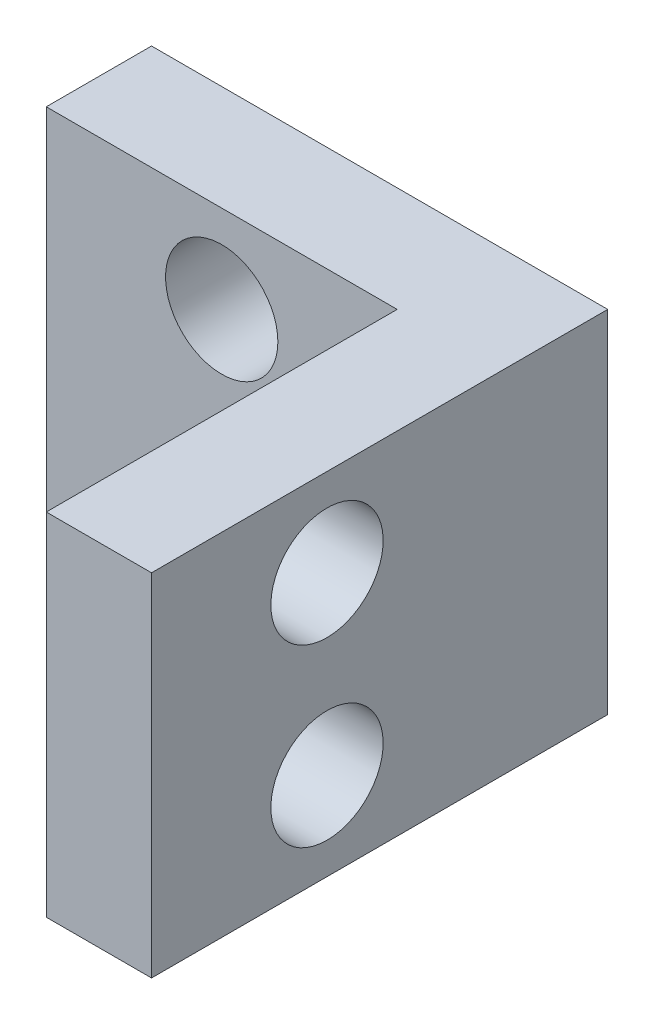
ISO-10303-21;
HEADER;
FILE_DESCRIPTION(('STEP AP214'),'2;1');
FILE_NAME('part.step','',(''),(''),'','','');
FILE_SCHEMA(('AUTOMOTIVE_DESIGN { 1 0 10303 214 1 1 1 1 }'));
ENDSEC;
DATA;
#1=APPLICATION_CONTEXT('core data for automotive mechanical design processes');
#2=APPLICATION_PROTOCOL_DEFINITION('international standard','automotive_design',2000,#1);
#3=PRODUCT_CONTEXT('',#1,'mechanical');
#4=PRODUCT('Part','Part','',(#3));
#5=PRODUCT_RELATED_PRODUCT_CATEGORY('part','',(#4));
#6=PRODUCT_DEFINITION_FORMATION('','',#4);
#7=PRODUCT_DEFINITION_CONTEXT('part definition',#1,'design');
#8=PRODUCT_DEFINITION('design','',#6,#7);
#9=PRODUCT_DEFINITION_SHAPE('','',#8);
#10=(LENGTH_UNIT() NAMED_UNIT(*) SI_UNIT(.MILLI.,.METRE.));
#11=(NAMED_UNIT(*) PLANE_ANGLE_UNIT() SI_UNIT($,.RADIAN.));
#12=(NAMED_UNIT(*) SI_UNIT($,.STERADIAN.) SOLID_ANGLE_UNIT());
#13=UNCERTAINTY_MEASURE_WITH_UNIT(LENGTH_MEASURE(1.E-05),#10,'distance_accuracy_value','');
#14=(GEOMETRIC_REPRESENTATION_CONTEXT(3) GLOBAL_UNCERTAINTY_ASSIGNED_CONTEXT((#13)) GLOBAL_UNIT_ASSIGNED_CONTEXT((#10,
#11,#12)) REPRESENTATION_CONTEXT('',''));
#15=CARTESIAN_POINT('',(0.,0.,0.));
#16=DIRECTION('',(0.,0.,1.));
#17=DIRECTION('',(1.,0.,0.));
#18=AXIS2_PLACEMENT_3D('',#15,#16,#17);
#19=CARTESIAN_POINT('',(0.,0.,3.));
#20=DIRECTION('',(1.,0.,0.));
#21=DIRECTION('',(0.,1.,0.));
#22=AXIS2_PLACEMENT_3D('',#19,#20,#21);
#23=PLANE('',#22);
#24=DIRECTION('',(0.,-1.,0.));
#25=VECTOR('',#24,1.);
#26=CARTESIAN_POINT('',(0.,0.,0.));
#27=LINE('',#26,#25);
#28=CARTESIAN_POINT('',(0.,0.,0.));
#29=VERTEX_POINT('',#28);
#30=CARTESIAN_POINT('',(0.,-10.,0.));
#31=VERTEX_POINT('',#30);
#32=EDGE_CURVE('E96',#29,#31,#27,.T.);
#33=ORIENTED_EDGE('',*,*,#32,.T.);
#34=DIRECTION('',(0.,0.,-1.));
#35=VECTOR('',#34,1.);
#36=CARTESIAN_POINT('',(0.,-10.,3.));
#37=LINE('',#36,#35);
#38=CARTESIAN_POINT('',(0.,-10.,3.));
#39=VERTEX_POINT('',#38);
#40=EDGE_CURVE('E11',#39,#31,#37,.T.);
#41=ORIENTED_EDGE('',*,*,#40,.F.);
#42=DIRECTION('',(0.,-1.,0.));
#43=VECTOR('',#42,1.);
#44=CARTESIAN_POINT('',(0.,0.,3.));
#45=LINE('',#44,#43);
#46=CARTESIAN_POINT('',(0.,0.,3.));
#47=VERTEX_POINT('',#46);
#48=EDGE_CURVE('E88',#47,#39,#45,.T.);
#49=ORIENTED_EDGE('',*,*,#48,.F.);
#50=DIRECTION('',(0.,0.,-1.));
#51=VECTOR('',#50,1.);
#52=CARTESIAN_POINT('',(0.,0.,3.));
#53=LINE('',#52,#51);
#54=EDGE_CURVE('E44',#47,#29,#53,.T.);
#55=ORIENTED_EDGE('',*,*,#54,.T.);
#56=EDGE_LOOP('',(#33,#41,#49,#55));
#57=FACE_BOUND('',#56,.T.);
#58=ADVANCED_FACE('F36',(#57),#23,.F.);
#59=CARTESIAN_POINT('',(0.,-10.,3.));
#60=DIRECTION('',(0.,1.,0.));
#61=DIRECTION('',(0.,0.,1.));
#62=AXIS2_PLACEMENT_3D('',#59,#60,#61);
#63=PLANE('',#62);
#64=DIRECTION('',(1.,0.,0.));
#65=VECTOR('',#64,1.);
#66=CARTESIAN_POINT('',(0.,-10.,0.));
#67=LINE('',#66,#65);
#68=CARTESIAN_POINT('',(13.,-10.,0.));
#69=VERTEX_POINT('',#68);
#70=EDGE_CURVE('E65',#31,#69,#67,.T.);
#71=ORIENTED_EDGE('',*,*,#70,.T.);
#72=DIRECTION('',(0.,0.,-1.));
#73=VECTOR('',#72,1.);
#74=CARTESIAN_POINT('',(13.,-10.,0.));
#75=LINE('',#74,#73);
#76=CARTESIAN_POINT('',(13.,-10.,13.));
#77=VERTEX_POINT('',#76);
#78=EDGE_CURVE('E109',#77,#69,#75,.T.);
#79=ORIENTED_EDGE('',*,*,#78,.F.);
#80=DIRECTION('',(-1.,0.,0.));
#81=VECTOR('',#80,1.);
#82=CARTESIAN_POINT('',(13.,-10.,13.));
#83=LINE('',#82,#81);
#84=CARTESIAN_POINT('',(10.,-10.,13.));
#85=VERTEX_POINT('',#84);
#86=EDGE_CURVE('E102',#77,#85,#83,.T.);
#87=ORIENTED_EDGE('',*,*,#86,.T.);
#88=DIRECTION('',(0.,0.,-1.));
#89=VECTOR('',#88,1.);
#90=CARTESIAN_POINT('',(10.,-10.,0.));
#91=LINE('',#90,#89);
#92=CARTESIAN_POINT('',(10.,-10.,3.));
#93=VERTEX_POINT('',#92);
#94=EDGE_CURVE('E87',#85,#93,#91,.T.);
#95=ORIENTED_EDGE('',*,*,#94,.T.);
#96=DIRECTION('',(1.,0.,0.));
#97=VECTOR('',#96,1.);
#98=CARTESIAN_POINT('',(0.,-10.,3.));
#99=LINE('',#98,#97);
#100=EDGE_CURVE('E82',#39,#93,#99,.T.);
#101=ORIENTED_EDGE('',*,*,#100,.F.);
#102=ORIENTED_EDGE('',*,*,#40,.T.);
#103=EDGE_LOOP('',(#71,#79,#87,#95,#101,#102));
#104=FACE_BOUND('',#103,.T.);
#105=ADVANCED_FACE('F83',(#104),#63,.F.);
#106=CARTESIAN_POINT('',(0.,0.,3.));
#107=DIRECTION('',(0.,-1.,0.));
#108=DIRECTION('',(0.,0.,-1.));
#109=AXIS2_PLACEMENT_3D('',#106,#107,#108);
#110=PLANE('',#109);
#111=DIRECTION('',(-1.,0.,0.));
#112=VECTOR('',#111,1.);
#113=CARTESIAN_POINT('',(0.,0.,0.));
#114=LINE('',#113,#112);
#115=CARTESIAN_POINT('',(13.,0.,0.));
#116=VERTEX_POINT('',#115);
#117=EDGE_CURVE('E94',#116,#29,#114,.T.);
#118=ORIENTED_EDGE('',*,*,#117,.T.);
#119=ORIENTED_EDGE('',*,*,#54,.F.);
#120=DIRECTION('',(-1.,0.,0.));
#121=VECTOR('',#120,1.);
#122=CARTESIAN_POINT('',(0.,0.,3.));
#123=LINE('',#122,#121);
#124=CARTESIAN_POINT('',(10.,0.,3.));
#125=VERTEX_POINT('',#124);
#126=EDGE_CURVE('E52',#125,#47,#123,.T.);
#127=ORIENTED_EDGE('',*,*,#126,.F.);
#128=DIRECTION('',(0.,0.,1.));
#129=VECTOR('',#128,1.);
#130=CARTESIAN_POINT('',(10.,0.,0.));
#131=LINE('',#130,#129);
#132=CARTESIAN_POINT('',(10.,0.,13.));
#133=VERTEX_POINT('',#132);
#134=EDGE_CURVE('E115',#125,#133,#131,.T.);
#135=ORIENTED_EDGE('',*,*,#134,.T.);
#136=DIRECTION('',(-1.,0.,0.));
#137=VECTOR('',#136,1.);
#138=CARTESIAN_POINT('',(13.,0.,13.));
#139=LINE('',#138,#137);
#140=CARTESIAN_POINT('',(13.,0.,13.));
#141=VERTEX_POINT('',#140);
#142=EDGE_CURVE('E98',#141,#133,#139,.T.);
#143=ORIENTED_EDGE('',*,*,#142,.F.);
#144=DIRECTION('',(0.,0.,1.));
#145=VECTOR('',#144,1.);
#146=CARTESIAN_POINT('',(13.,0.,0.));
#147=LINE('',#146,#145);
#148=EDGE_CURVE('E124',#116,#141,#147,.T.);
#149=ORIENTED_EDGE('',*,*,#148,.F.);
#150=EDGE_LOOP('',(#118,#119,#127,#135,#143,#149));
#151=FACE_BOUND('',#150,.T.);
#152=ADVANCED_FACE('F186',(#151),#110,.F.);
#153=CARTESIAN_POINT('',(0.,0.,3.));
#154=DIRECTION('',(0.,0.,1.));
#155=DIRECTION('',(1.,0.,0.));
#156=AXIS2_PLACEMENT_3D('',#153,#154,#155);
#157=PLANE('',#156);
#158=CARTESIAN_POINT('',(5.,-2.5,3.));
#159=DIRECTION('',(0.,0.,1.));
#160=DIRECTION('',(1.,0.,0.));
#161=AXIS2_PLACEMENT_3D('',#158,#159,#160);
#162=CIRCLE('',#161,1.6);
#163=CARTESIAN_POINT('',(6.6,-2.5,3.));
#164=VERTEX_POINT('',#163);
#165=EDGE_CURVE('E136',#164,#164,#162,.T.);
#166=ORIENTED_EDGE('',*,*,#165,.F.);
#167=EDGE_LOOP('',(#166));
#168=FACE_BOUND('',#167,.T.);
#169=CARTESIAN_POINT('',(5.,-7.5,3.));
#170=DIRECTION('',(0.,0.,1.));
#171=DIRECTION('',(1.,0.,0.));
#172=AXIS2_PLACEMENT_3D('',#169,#170,#171);
#173=CIRCLE('',#172,1.6);
#174=CARTESIAN_POINT('',(6.6,-7.5,3.));
#175=VERTEX_POINT('',#174);
#176=EDGE_CURVE('E129',#175,#175,#173,.T.);
#177=ORIENTED_EDGE('',*,*,#176,.F.);
#178=EDGE_LOOP('',(#177));
#179=FACE_BOUND('',#178,.T.);
#180=ORIENTED_EDGE('',*,*,#48,.T.);
#181=ORIENTED_EDGE('',*,*,#100,.T.);
#182=DIRECTION('',(0.,1.,0.));
#183=VECTOR('',#182,1.);
#184=CARTESIAN_POINT('',(10.,0.,3.));
#185=LINE('',#184,#183);
#186=EDGE_CURVE('E72',#93,#125,#185,.T.);
#187=ORIENTED_EDGE('',*,*,#186,.T.);
#188=ORIENTED_EDGE('',*,*,#126,.T.);
#189=EDGE_LOOP('',(#180,#181,#187,#188));
#190=FACE_BOUND('',#189,.T.);
#191=ADVANCED_FACE('F91',(#168,#179,#190),#157,.T.);
#192=CARTESIAN_POINT('',(0.,0.,0.));
#193=DIRECTION('',(0.,0.,1.));
#194=DIRECTION('',(1.,0.,0.));
#195=AXIS2_PLACEMENT_3D('',#192,#193,#194);
#196=PLANE('',#195);
#197=CARTESIAN_POINT('',(5.,-2.5,0.));
#198=DIRECTION('',(0.,0.,1.));
#199=DIRECTION('',(1.,0.,0.));
#200=AXIS2_PLACEMENT_3D('',#197,#198,#199);
#201=CIRCLE('',#200,1.6);
#202=CARTESIAN_POINT('',(6.6,-2.5,0.));
#203=VERTEX_POINT('',#202);
#204=EDGE_CURVE('E118',#203,#203,#201,.T.);
#205=ORIENTED_EDGE('',*,*,#204,.T.);
#206=EDGE_LOOP('',(#205));
#207=FACE_BOUND('',#206,.T.);
#208=CARTESIAN_POINT('',(5.,-7.5,0.));
#209=DIRECTION('',(0.,0.,1.));
#210=DIRECTION('',(1.,0.,0.));
#211=AXIS2_PLACEMENT_3D('',#208,#209,#210);
#212=CIRCLE('',#211,1.6);
#213=CARTESIAN_POINT('',(6.6,-7.5,0.));
#214=VERTEX_POINT('',#213);
#215=EDGE_CURVE('E132',#214,#214,#212,.T.);
#216=ORIENTED_EDGE('',*,*,#215,.T.);
#217=EDGE_LOOP('',(#216));
#218=FACE_BOUND('',#217,.T.);
#219=ORIENTED_EDGE('',*,*,#32,.F.);
#220=ORIENTED_EDGE('',*,*,#117,.F.);
#221=DIRECTION('',(0.,1.,0.));
#222=VECTOR('',#221,1.);
#223=CARTESIAN_POINT('',(13.,0.,0.));
#224=LINE('',#223,#222);
#225=EDGE_CURVE('E111',#69,#116,#224,.T.);
#226=ORIENTED_EDGE('',*,*,#225,.F.);
#227=ORIENTED_EDGE('',*,*,#70,.F.);
#228=EDGE_LOOP('',(#219,#220,#226,#227));
#229=FACE_BOUND('',#228,.T.);
#230=ADVANCED_FACE('F167',(#207,#218,#229),#196,.F.);
#231=CARTESIAN_POINT('',(10.,0.,0.));
#232=DIRECTION('',(-1.,0.,0.));
#233=DIRECTION('',(0.,-1.,0.));
#234=AXIS2_PLACEMENT_3D('',#231,#232,#233);
#235=PLANE('',#234);
#236=CARTESIAN_POINT('',(10.,-2.5,8.));
#237=DIRECTION('',(-1.,0.,0.));
#238=DIRECTION('',(0.,-1.,0.));
#239=AXIS2_PLACEMENT_3D('',#236,#237,#238);
#240=CIRCLE('',#239,1.6);
#241=CARTESIAN_POINT('',(10.,-4.1,8.));
#242=VERTEX_POINT('',#241);
#243=EDGE_CURVE('E147',#242,#242,#240,.T.);
#244=ORIENTED_EDGE('',*,*,#243,.F.);
#245=EDGE_LOOP('',(#244));
#246=FACE_BOUND('',#245,.T.);
#247=CARTESIAN_POINT('',(10.,-7.5,8.));
#248=DIRECTION('',(-1.,0.,0.));
#249=DIRECTION('',(0.,-1.,0.));
#250=AXIS2_PLACEMENT_3D('',#247,#248,#249);
#251=CIRCLE('',#250,1.6);
#252=CARTESIAN_POINT('',(10.,-9.1,8.));
#253=VERTEX_POINT('',#252);
#254=EDGE_CURVE('E141',#253,#253,#251,.T.);
#255=ORIENTED_EDGE('',*,*,#254,.F.);
#256=EDGE_LOOP('',(#255));
#257=FACE_BOUND('',#256,.T.);
#258=ORIENTED_EDGE('',*,*,#186,.F.);
#259=ORIENTED_EDGE('',*,*,#94,.F.);
#260=DIRECTION('',(0.,-1.,0.));
#261=VECTOR('',#260,1.);
#262=CARTESIAN_POINT('',(10.,0.,13.));
#263=LINE('',#262,#261);
#264=EDGE_CURVE('E112',#133,#85,#263,.T.);
#265=ORIENTED_EDGE('',*,*,#264,.F.);
#266=ORIENTED_EDGE('',*,*,#134,.F.);
#267=EDGE_LOOP('',(#258,#259,#265,#266));
#268=FACE_BOUND('',#267,.T.);
#269=ADVANCED_FACE('F163',(#246,#257,#268),#235,.T.);
#270=CARTESIAN_POINT('',(13.,0.,13.));
#271=DIRECTION('',(0.,0.,-1.));
#272=DIRECTION('',(0.,1.,0.));
#273=AXIS2_PLACEMENT_3D('',#270,#271,#272);
#274=PLANE('',#273);
#275=ORIENTED_EDGE('',*,*,#264,.T.);
#276=ORIENTED_EDGE('',*,*,#86,.F.);
#277=DIRECTION('',(0.,-1.,0.));
#278=VECTOR('',#277,1.);
#279=CARTESIAN_POINT('',(13.,0.,13.));
#280=LINE('',#279,#278);
#281=EDGE_CURVE('E121',#141,#77,#280,.T.);
#282=ORIENTED_EDGE('',*,*,#281,.F.);
#283=ORIENTED_EDGE('',*,*,#142,.T.);
#284=EDGE_LOOP('',(#275,#276,#282,#283));
#285=FACE_BOUND('',#284,.T.);
#286=ADVANCED_FACE('F166',(#285),#274,.F.);
#287=CARTESIAN_POINT('',(13.,0.,0.));
#288=DIRECTION('',(-1.,0.,0.));
#289=DIRECTION('',(0.,-1.,0.));
#290=AXIS2_PLACEMENT_3D('',#287,#288,#289);
#291=PLANE('',#290);
#292=CARTESIAN_POINT('',(13.,-2.5,8.));
#293=DIRECTION('',(-1.,0.,0.));
#294=DIRECTION('',(0.,-1.,0.));
#295=AXIS2_PLACEMENT_3D('',#292,#293,#294);
#296=CIRCLE('',#295,1.6);
#297=CARTESIAN_POINT('',(13.,-4.1,8.));
#298=VERTEX_POINT('',#297);
#299=EDGE_CURVE('E133',#298,#298,#296,.T.);
#300=ORIENTED_EDGE('',*,*,#299,.T.);
#301=EDGE_LOOP('',(#300));
#302=FACE_BOUND('',#301,.T.);
#303=CARTESIAN_POINT('',(13.,-7.5,8.));
#304=DIRECTION('',(-1.,0.,0.));
#305=DIRECTION('',(0.,-1.,0.));
#306=AXIS2_PLACEMENT_3D('',#303,#304,#305);
#307=CIRCLE('',#306,1.6);
#308=CARTESIAN_POINT('',(13.,-9.1,8.));
#309=VERTEX_POINT('',#308);
#310=EDGE_CURVE('E144',#309,#309,#307,.T.);
#311=ORIENTED_EDGE('',*,*,#310,.T.);
#312=EDGE_LOOP('',(#311));
#313=FACE_BOUND('',#312,.T.);
#314=ORIENTED_EDGE('',*,*,#225,.T.);
#315=ORIENTED_EDGE('',*,*,#148,.T.);
#316=ORIENTED_EDGE('',*,*,#281,.T.);
#317=ORIENTED_EDGE('',*,*,#78,.T.);
#318=EDGE_LOOP('',(#314,#315,#316,#317));
#319=FACE_BOUND('',#318,.T.);
#320=ADVANCED_FACE('F153',(#302,#313,#319),#291,.F.);
#321=CARTESIAN_POINT('',(5.,-7.5,0.));
#322=DIRECTION('',(0.,0.,1.));
#323=DIRECTION('',(1.,0.,0.));
#324=AXIS2_PLACEMENT_3D('',#321,#322,#323);
#325=CYLINDRICAL_SURFACE('',#324,1.6);
#326=ORIENTED_EDGE('',*,*,#215,.F.);
#327=EDGE_LOOP('',(#326));
#328=FACE_BOUND('',#327,.T.);
#329=ORIENTED_EDGE('',*,*,#176,.T.);
#330=EDGE_LOOP('',(#329));
#331=FACE_BOUND('',#330,.T.);
#332=ADVANCED_FACE('F178',(#328,#331),#325,.F.);
#333=CARTESIAN_POINT('',(5.,-2.5,0.));
#334=DIRECTION('',(0.,0.,1.));
#335=DIRECTION('',(1.,0.,0.));
#336=AXIS2_PLACEMENT_3D('',#333,#334,#335);
#337=CYLINDRICAL_SURFACE('',#336,1.6);
#338=ORIENTED_EDGE('',*,*,#204,.F.);
#339=EDGE_LOOP('',(#338));
#340=FACE_BOUND('',#339,.T.);
#341=ORIENTED_EDGE('',*,*,#165,.T.);
#342=EDGE_LOOP('',(#341));
#343=FACE_BOUND('',#342,.T.);
#344=ADVANCED_FACE('F172',(#340,#343),#337,.F.);
#345=CARTESIAN_POINT('',(13.,-7.5,8.));
#346=DIRECTION('',(-1.,0.,0.));
#347=DIRECTION('',(0.,-1.,0.));
#348=AXIS2_PLACEMENT_3D('',#345,#346,#347);
#349=CYLINDRICAL_SURFACE('',#348,1.6);
#350=ORIENTED_EDGE('',*,*,#310,.F.);
#351=EDGE_LOOP('',(#350));
#352=FACE_BOUND('',#351,.T.);
#353=ORIENTED_EDGE('',*,*,#254,.T.);
#354=EDGE_LOOP('',(#353));
#355=FACE_BOUND('',#354,.T.);
#356=ADVANCED_FACE('F159',(#352,#355),#349,.F.);
#357=CARTESIAN_POINT('',(13.,-2.5,8.));
#358=DIRECTION('',(-1.,0.,0.));
#359=DIRECTION('',(0.,-1.,0.));
#360=AXIS2_PLACEMENT_3D('',#357,#358,#359);
#361=CYLINDRICAL_SURFACE('',#360,1.6);
#362=ORIENTED_EDGE('',*,*,#299,.F.);
#363=EDGE_LOOP('',(#362));
#364=FACE_BOUND('',#363,.T.);
#365=ORIENTED_EDGE('',*,*,#243,.T.);
#366=EDGE_LOOP('',(#365));
#367=FACE_BOUND('',#366,.T.);
#368=ADVANCED_FACE('F156',(#364,#367),#361,.F.);
#369=CLOSED_SHELL('',(#58,#105,#152,#191,#230,#269,#286,#320,#332,#344,#356,#368));
#370=MANIFOLD_SOLID_BREP('B2',#369);
#371=ADVANCED_BREP_SHAPE_REPRESENTATION('',(#18,#370),#14);
#372=SHAPE_DEFINITION_REPRESENTATION(#9,#371);
ENDSEC;
END-ISO-10303-21;
